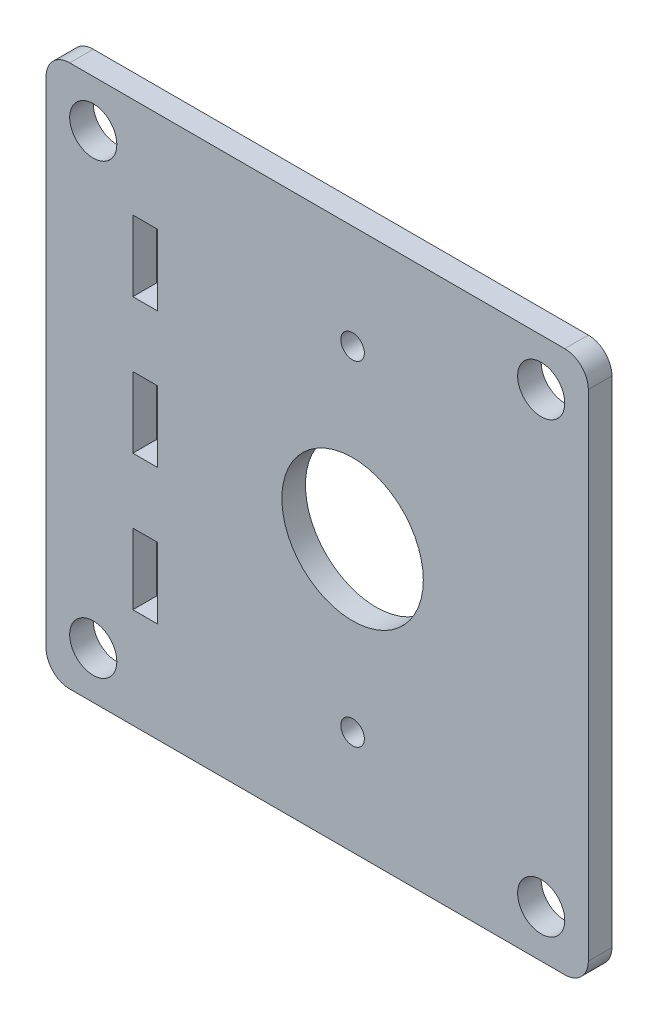
ISO-10303-21;
HEADER;
FILE_DESCRIPTION(('STEP AP214'),'2;1');
FILE_NAME('part.step','',(''),(''),'','','');
FILE_SCHEMA(('AUTOMOTIVE_DESIGN { 1 0 10303 214 1 1 1 1 }'));
ENDSEC;
DATA;
#1=APPLICATION_CONTEXT('core data for automotive mechanical design processes');
#2=APPLICATION_PROTOCOL_DEFINITION('international standard','automotive_design',2000,#1);
#3=PRODUCT_CONTEXT('',#1,'mechanical');
#4=PRODUCT('Part','Part','',(#3));
#5=PRODUCT_RELATED_PRODUCT_CATEGORY('part','',(#4));
#6=PRODUCT_DEFINITION_FORMATION('','',#4);
#7=PRODUCT_DEFINITION_CONTEXT('part definition',#1,'design');
#8=PRODUCT_DEFINITION('design','',#6,#7);
#9=PRODUCT_DEFINITION_SHAPE('','',#8);
#10=(LENGTH_UNIT() NAMED_UNIT(*) SI_UNIT(.MILLI.,.METRE.));
#11=(NAMED_UNIT(*) PLANE_ANGLE_UNIT() SI_UNIT($,.RADIAN.));
#12=(NAMED_UNIT(*) SI_UNIT($,.STERADIAN.) SOLID_ANGLE_UNIT());
#13=UNCERTAINTY_MEASURE_WITH_UNIT(LENGTH_MEASURE(1.E-05),#10,'distance_accuracy_value','');
#14=(GEOMETRIC_REPRESENTATION_CONTEXT(3) GLOBAL_UNCERTAINTY_ASSIGNED_CONTEXT((#13)) GLOBAL_UNIT_ASSIGNED_CONTEXT((#10,
#11,#12)) REPRESENTATION_CONTEXT('',''));
#15=CARTESIAN_POINT('',(0.,0.,0.));
#16=DIRECTION('',(0.,0.,1.));
#17=DIRECTION('',(1.,0.,0.));
#18=AXIS2_PLACEMENT_3D('',#15,#16,#17);
#19=CARTESIAN_POINT('',(0.,0.,3.175));
#20=DIRECTION('',(0.,0.,-1.));
#21=DIRECTION('',(-1.,0.,0.));
#22=AXIS2_PLACEMENT_3D('',#19,#20,#21);
#23=PLANE('',#22);
#24=DIRECTION('',(0.,1.,0.));
#25=VECTOR('',#24,1.);
#26=CARTESIAN_POINT('',(-52.578,-9.525,3.175));
#27=LINE('',#26,#25);
#28=CARTESIAN_POINT('',(-52.578,-9.525,3.175));
#29=VERTEX_POINT('',#28);
#30=CARTESIAN_POINT('',(-52.578,9.525,3.175));
#31=VERTEX_POINT('',#30);
#32=EDGE_CURVE('E213',#29,#31,#27,.T.);
#33=ORIENTED_EDGE('',*,*,#32,.F.);
#34=DIRECTION('',(1.,0.,0.));
#35=VECTOR('',#34,1.);
#36=CARTESIAN_POINT('',(-59.182,-9.525,3.175));
#37=LINE('',#36,#35);
#38=CARTESIAN_POINT('',(-59.182,-9.525,3.175));
#39=VERTEX_POINT('',#38);
#40=EDGE_CURVE('E221',#39,#29,#37,.T.);
#41=ORIENTED_EDGE('',*,*,#40,.F.);
#42=DIRECTION('',(0.,-1.,0.));
#43=VECTOR('',#42,1.);
#44=CARTESIAN_POINT('',(-59.182,-9.525,3.175));
#45=LINE('',#44,#43);
#46=CARTESIAN_POINT('',(-59.182,9.525,3.175));
#47=VERTEX_POINT('',#46);
#48=EDGE_CURVE('E218',#47,#39,#45,.T.);
#49=ORIENTED_EDGE('',*,*,#48,.F.);
#50=DIRECTION('',(-1.,0.,0.));
#51=VECTOR('',#50,1.);
#52=CARTESIAN_POINT('',(-59.182,9.525,3.175));
#53=LINE('',#52,#51);
#54=EDGE_CURVE('E215',#31,#47,#53,.T.);
#55=ORIENTED_EDGE('',*,*,#54,.F.);
#56=EDGE_LOOP('',(#33,#41,#49,#55));
#57=FACE_BOUND('',#56,.T.);
#58=CARTESIAN_POINT('',(-69.85,-60.325,3.175));
#59=DIRECTION('',(0.,0.,1.));
#60=DIRECTION('',(1.,0.,0.));
#61=AXIS2_PLACEMENT_3D('',#58,#59,#60);
#62=CIRCLE('',#61,6.35000000000001);
#63=CARTESIAN_POINT('',(-63.5,-60.325,3.175));
#64=VERTEX_POINT('',#63);
#65=EDGE_CURVE('E275',#64,#64,#62,.T.);
#66=ORIENTED_EDGE('',*,*,#65,.F.);
#67=EDGE_LOOP('',(#66));
#68=FACE_BOUND('',#67,.T.);
#69=CARTESIAN_POINT('',(-69.85,60.325,3.175));
#70=DIRECTION('',(0.,0.,1.));
#71=DIRECTION('',(1.,0.,0.));
#72=AXIS2_PLACEMENT_3D('',#69,#70,#71);
#73=CIRCLE('',#72,6.35000000000001);
#74=CARTESIAN_POINT('',(-63.5,60.325,3.175));
#75=VERTEX_POINT('',#74);
#76=EDGE_CURVE('E281',#75,#75,#73,.T.);
#77=ORIENTED_EDGE('',*,*,#76,.F.);
#78=EDGE_LOOP('',(#77));
#79=FACE_BOUND('',#78,.T.);
#80=CARTESIAN_POINT('',(0.,-45.,3.175));
#81=DIRECTION('',(0.,0.,1.));
#82=DIRECTION('',(1.,0.,0.));
#83=AXIS2_PLACEMENT_3D('',#80,#81,#82);
#84=CIRCLE('',#83,3.175);
#85=CARTESIAN_POINT('',(3.17500000000001,-45.,3.175));
#86=VERTEX_POINT('',#85);
#87=EDGE_CURVE('E287',#86,#86,#84,.T.);
#88=ORIENTED_EDGE('',*,*,#87,.F.);
#89=EDGE_LOOP('',(#88));
#90=FACE_BOUND('',#89,.T.);
#91=CARTESIAN_POINT('',(0.,0.,3.175));
#92=DIRECTION('',(0.,0.,1.));
#93=DIRECTION('',(1.,0.,0.));
#94=AXIS2_PLACEMENT_3D('',#91,#92,#93);
#95=CIRCLE('',#94,19.05);
#96=CARTESIAN_POINT('',(19.05,0.,3.175));
#97=VERTEX_POINT('',#96);
#98=EDGE_CURVE('E293',#97,#97,#95,.T.);
#99=ORIENTED_EDGE('',*,*,#98,.F.);
#100=EDGE_LOOP('',(#99));
#101=FACE_BOUND('',#100,.T.);
#102=CARTESIAN_POINT('',(0.,45.,3.175));
#103=DIRECTION('',(0.,0.,1.));
#104=DIRECTION('',(1.,0.,0.));
#105=AXIS2_PLACEMENT_3D('',#102,#103,#104);
#106=CIRCLE('',#105,3.175);
#107=CARTESIAN_POINT('',(3.17499999999999,45.,3.175));
#108=VERTEX_POINT('',#107);
#109=EDGE_CURVE('E299',#108,#108,#106,.T.);
#110=ORIENTED_EDGE('',*,*,#109,.F.);
#111=EDGE_LOOP('',(#110));
#112=FACE_BOUND('',#111,.T.);
#113=CARTESIAN_POINT('',(50.8,-60.325,3.175));
#114=DIRECTION('',(0.,0.,1.));
#115=DIRECTION('',(1.,0.,0.));
#116=AXIS2_PLACEMENT_3D('',#113,#114,#115);
#117=CIRCLE('',#116,6.35);
#118=CARTESIAN_POINT('',(57.15,-60.325,3.175));
#119=VERTEX_POINT('',#118);
#120=EDGE_CURVE('E305',#119,#119,#117,.T.);
#121=ORIENTED_EDGE('',*,*,#120,.F.);
#122=EDGE_LOOP('',(#121));
#123=FACE_BOUND('',#122,.T.);
#124=CARTESIAN_POINT('',(50.8,60.325,3.175));
#125=DIRECTION('',(0.,0.,1.));
#126=DIRECTION('',(1.,0.,0.));
#127=AXIS2_PLACEMENT_3D('',#124,#125,#126);
#128=CIRCLE('',#127,6.35);
#129=CARTESIAN_POINT('',(57.15,60.325,3.175));
#130=VERTEX_POINT('',#129);
#131=EDGE_CURVE('E311',#130,#130,#128,.T.);
#132=ORIENTED_EDGE('',*,*,#131,.F.);
#133=EDGE_LOOP('',(#132));
#134=FACE_BOUND('',#133,.T.);
#135=DIRECTION('',(1.,0.,0.));
#136=VECTOR('',#135,1.);
#137=CARTESIAN_POINT('',(63.5,-73.025,3.175));
#138=LINE('',#137,#136);
#139=CARTESIAN_POINT('',(-76.2,-73.025,3.175));
#140=VERTEX_POINT('',#139);
#141=CARTESIAN_POINT('',(57.15,-73.025,3.175));
#142=VERTEX_POINT('',#141);
#143=EDGE_CURVE('E320',#140,#142,#138,.T.);
#144=ORIENTED_EDGE('',*,*,#143,.T.);
#145=CARTESIAN_POINT('',(57.15,-66.675,3.175));
#146=DIRECTION('',(0.,0.,-1.));
#147=DIRECTION('',(-1.,0.,0.));
#148=AXIS2_PLACEMENT_3D('',#145,#146,#147);
#149=CIRCLE('',#148,6.35);
#150=CARTESIAN_POINT('',(63.5,-66.675,3.175));
#151=VERTEX_POINT('',#150);
#152=EDGE_CURVE('E360',#142,#151,#149,.F.);
#153=ORIENTED_EDGE('',*,*,#152,.T.);
#154=DIRECTION('',(0.,1.,0.));
#155=VECTOR('',#154,1.);
#156=CARTESIAN_POINT('',(63.5,73.025,3.175));
#157=LINE('',#156,#155);
#158=CARTESIAN_POINT('',(63.5,66.675,3.175));
#159=VERTEX_POINT('',#158);
#160=EDGE_CURVE('E324',#151,#159,#157,.T.);
#161=ORIENTED_EDGE('',*,*,#160,.T.);
#162=CARTESIAN_POINT('',(57.15,66.675,3.175));
#163=DIRECTION('',(0.,0.,-1.));
#164=DIRECTION('',(-1.,0.,0.));
#165=AXIS2_PLACEMENT_3D('',#162,#163,#164);
#166=CIRCLE('',#165,6.35);
#167=CARTESIAN_POINT('',(57.15,73.025,3.175));
#168=VERTEX_POINT('',#167);
#169=EDGE_CURVE('E54',#159,#168,#166,.F.);
#170=ORIENTED_EDGE('',*,*,#169,.T.);
#171=DIRECTION('',(-1.,0.,0.));
#172=VECTOR('',#171,1.);
#173=CARTESIAN_POINT('',(63.5,73.025,3.175));
#174=LINE('',#173,#172);
#175=CARTESIAN_POINT('',(-76.2,73.025,3.175));
#176=VERTEX_POINT('',#175);
#177=EDGE_CURVE('E326',#168,#176,#174,.T.);
#178=ORIENTED_EDGE('',*,*,#177,.T.);
#179=CARTESIAN_POINT('',(-76.2,66.675,3.175));
#180=DIRECTION('',(0.,0.,-1.));
#181=DIRECTION('',(-1.,0.,0.));
#182=AXIS2_PLACEMENT_3D('',#179,#180,#181);
#183=CIRCLE('',#182,6.35);
#184=CARTESIAN_POINT('',(-82.55,66.675,3.175));
#185=VERTEX_POINT('',#184);
#186=EDGE_CURVE('E356',#176,#185,#183,.F.);
#187=ORIENTED_EDGE('',*,*,#186,.T.);
#188=DIRECTION('',(0.,-1.,0.));
#189=VECTOR('',#188,1.);
#190=CARTESIAN_POINT('',(-82.55,73.025,3.175));
#191=LINE('',#190,#189);
#192=CARTESIAN_POINT('',(-82.55,-66.675,3.175));
#193=VERTEX_POINT('',#192);
#194=EDGE_CURVE('E317',#185,#193,#191,.T.);
#195=ORIENTED_EDGE('',*,*,#194,.T.);
#196=CARTESIAN_POINT('',(-76.2,-66.675,3.175));
#197=DIRECTION('',(0.,0.,-1.));
#198=DIRECTION('',(-1.,0.,0.));
#199=AXIS2_PLACEMENT_3D('',#196,#197,#198);
#200=CIRCLE('',#199,6.35);
#201=EDGE_CURVE('E358',#193,#140,#200,.F.);
#202=ORIENTED_EDGE('',*,*,#201,.T.);
#203=EDGE_LOOP('',(#144,#153,#161,#170,#178,#187,#195,#202));
#204=FACE_BOUND('',#203,.T.);
#205=DIRECTION('',(0.,1.,0.));
#206=VECTOR('',#205,1.);
#207=CARTESIAN_POINT('',(-52.578,46.0375,3.175));
#208=LINE('',#207,#206);
#209=CARTESIAN_POINT('',(-52.578,26.9875,3.175));
#210=VERTEX_POINT('',#209);
#211=CARTESIAN_POINT('',(-52.578,46.0375,3.175));
#212=VERTEX_POINT('',#211);
#213=EDGE_CURVE('E244',#210,#212,#208,.T.);
#214=ORIENTED_EDGE('',*,*,#213,.F.);
#215=DIRECTION('',(1.,0.,0.));
#216=VECTOR('',#215,1.);
#217=CARTESIAN_POINT('',(-59.182,26.9875,3.175));
#218=LINE('',#217,#216);
#219=CARTESIAN_POINT('',(-59.182,26.9875,3.175));
#220=VERTEX_POINT('',#219);
#221=EDGE_CURVE('E252',#220,#210,#218,.T.);
#222=ORIENTED_EDGE('',*,*,#221,.F.);
#223=DIRECTION('',(0.,-1.,0.));
#224=VECTOR('',#223,1.);
#225=CARTESIAN_POINT('',(-59.182,46.0375,3.175));
#226=LINE('',#225,#224);
#227=CARTESIAN_POINT('',(-59.182,46.0375,3.175));
#228=VERTEX_POINT('',#227);
#229=EDGE_CURVE('E249',#228,#220,#226,.T.);
#230=ORIENTED_EDGE('',*,*,#229,.F.);
#231=DIRECTION('',(-1.,0.,0.));
#232=VECTOR('',#231,1.);
#233=CARTESIAN_POINT('',(-59.182,46.0375,3.175));
#234=LINE('',#233,#232);
#235=EDGE_CURVE('E246',#212,#228,#234,.T.);
#236=ORIENTED_EDGE('',*,*,#235,.F.);
#237=EDGE_LOOP('',(#214,#222,#230,#236));
#238=FACE_BOUND('',#237,.T.);
#239=DIRECTION('',(0.,1.,0.));
#240=VECTOR('',#239,1.);
#241=CARTESIAN_POINT('',(-52.578,-26.9875,3.175));
#242=LINE('',#241,#240);
#243=CARTESIAN_POINT('',(-52.578,-46.0375,3.175));
#244=VERTEX_POINT('',#243);
#245=CARTESIAN_POINT('',(-52.578,-26.9875,3.175));
#246=VERTEX_POINT('',#245);
#247=EDGE_CURVE('E172',#244,#246,#242,.T.);
#248=ORIENTED_EDGE('',*,*,#247,.F.);
#249=DIRECTION('',(1.,0.,0.));
#250=VECTOR('',#249,1.);
#251=CARTESIAN_POINT('',(-59.182,-46.0375,3.175));
#252=LINE('',#251,#250);
#253=CARTESIAN_POINT('',(-59.182,-46.0375,3.175));
#254=VERTEX_POINT('',#253);
#255=EDGE_CURVE('E197',#254,#244,#252,.T.);
#256=ORIENTED_EDGE('',*,*,#255,.F.);
#257=DIRECTION('',(0.,-1.,0.));
#258=VECTOR('',#257,1.);
#259=CARTESIAN_POINT('',(-59.182,-26.9875,3.175));
#260=LINE('',#259,#258);
#261=CARTESIAN_POINT('',(-59.182,-26.9875,3.175));
#262=VERTEX_POINT('',#261);
#263=EDGE_CURVE('E195',#262,#254,#260,.T.);
#264=ORIENTED_EDGE('',*,*,#263,.F.);
#265=DIRECTION('',(-1.,0.,0.));
#266=VECTOR('',#265,1.);
#267=CARTESIAN_POINT('',(-59.182,-26.9875,3.175));
#268=LINE('',#267,#266);
#269=EDGE_CURVE('E182',#246,#262,#268,.T.);
#270=ORIENTED_EDGE('',*,*,#269,.F.);
#271=EDGE_LOOP('',(#248,#256,#264,#270));
#272=FACE_BOUND('',#271,.T.);
#273=ADVANCED_FACE('F34',(#57,#68,#79,#90,#101,#112,#123,#134,#204,#238,#272),#23,.F.);
#274=CARTESIAN_POINT('',(0.,0.,-3.175));
#275=DIRECTION('',(0.,0.,-1.));
#276=DIRECTION('',(-1.,0.,0.));
#277=AXIS2_PLACEMENT_3D('',#274,#275,#276);
#278=PLANE('',#277);
#279=CARTESIAN_POINT('',(-69.85,60.325,-3.175));
#280=DIRECTION('',(0.,0.,1.));
#281=DIRECTION('',(1.,0.,0.));
#282=AXIS2_PLACEMENT_3D('',#279,#280,#281);
#283=CIRCLE('',#282,6.35000000000001);
#284=CARTESIAN_POINT('',(-63.5,60.325,-3.175));
#285=VERTEX_POINT('',#284);
#286=EDGE_CURVE('E278',#285,#285,#283,.T.);
#287=ORIENTED_EDGE('',*,*,#286,.T.);
#288=EDGE_LOOP('',(#287));
#289=FACE_BOUND('',#288,.T.);
#290=CARTESIAN_POINT('',(0.,0.,-3.175));
#291=DIRECTION('',(0.,0.,1.));
#292=DIRECTION('',(1.,0.,0.));
#293=AXIS2_PLACEMENT_3D('',#290,#291,#292);
#294=CIRCLE('',#293,19.05);
#295=CARTESIAN_POINT('',(19.05,0.,-3.175));
#296=VERTEX_POINT('',#295);
#297=EDGE_CURVE('E290',#296,#296,#294,.T.);
#298=ORIENTED_EDGE('',*,*,#297,.T.);
#299=EDGE_LOOP('',(#298));
#300=FACE_BOUND('',#299,.T.);
#301=CARTESIAN_POINT('',(50.8,-60.325,-3.175));
#302=DIRECTION('',(0.,0.,1.));
#303=DIRECTION('',(1.,0.,0.));
#304=AXIS2_PLACEMENT_3D('',#301,#302,#303);
#305=CIRCLE('',#304,6.35);
#306=CARTESIAN_POINT('',(57.15,-60.325,-3.175));
#307=VERTEX_POINT('',#306);
#308=EDGE_CURVE('E302',#307,#307,#305,.T.);
#309=ORIENTED_EDGE('',*,*,#308,.T.);
#310=EDGE_LOOP('',(#309));
#311=FACE_BOUND('',#310,.T.);
#312=DIRECTION('',(0.,1.,0.));
#313=VECTOR('',#312,1.);
#314=CARTESIAN_POINT('',(63.5,73.025,-3.175));
#315=LINE('',#314,#313);
#316=CARTESIAN_POINT('',(63.5,-66.675,-3.175));
#317=VERTEX_POINT('',#316);
#318=CARTESIAN_POINT('',(63.5,66.675,-3.175));
#319=VERTEX_POINT('',#318);
#320=EDGE_CURVE('E334',#317,#319,#315,.T.);
#321=ORIENTED_EDGE('',*,*,#320,.F.);
#322=CARTESIAN_POINT('',(57.15,-66.675,-3.175));
#323=DIRECTION('',(0.,0.,-1.));
#324=DIRECTION('',(-1.,0.,0.));
#325=AXIS2_PLACEMENT_3D('',#322,#323,#324);
#326=CIRCLE('',#325,6.35);
#327=CARTESIAN_POINT('',(57.15,-73.025,-3.175));
#328=VERTEX_POINT('',#327);
#329=EDGE_CURVE('E348',#317,#328,#326,.T.);
#330=ORIENTED_EDGE('',*,*,#329,.T.);
#331=DIRECTION('',(1.,0.,0.));
#332=VECTOR('',#331,1.);
#333=CARTESIAN_POINT('',(63.5,-73.025,-3.175));
#334=LINE('',#333,#332);
#335=CARTESIAN_POINT('',(-76.2,-73.025,-3.175));
#336=VERTEX_POINT('',#335);
#337=EDGE_CURVE('E331',#336,#328,#334,.T.);
#338=ORIENTED_EDGE('',*,*,#337,.F.);
#339=CARTESIAN_POINT('',(-76.2,-66.675,-3.175));
#340=DIRECTION('',(0.,0.,-1.));
#341=DIRECTION('',(-1.,0.,0.));
#342=AXIS2_PLACEMENT_3D('',#339,#340,#341);
#343=CIRCLE('',#342,6.35);
#344=CARTESIAN_POINT('',(-82.55,-66.675,-3.175));
#345=VERTEX_POINT('',#344);
#346=EDGE_CURVE('E346',#336,#345,#343,.T.);
#347=ORIENTED_EDGE('',*,*,#346,.T.);
#348=DIRECTION('',(0.,-1.,0.));
#349=VECTOR('',#348,1.);
#350=CARTESIAN_POINT('',(-82.55,73.025,-3.175));
#351=LINE('',#350,#349);
#352=CARTESIAN_POINT('',(-82.55,66.675,-3.175));
#353=VERTEX_POINT('',#352);
#354=EDGE_CURVE('E314',#353,#345,#351,.T.);
#355=ORIENTED_EDGE('',*,*,#354,.F.);
#356=CARTESIAN_POINT('',(-76.2,66.675,-3.175));
#357=DIRECTION('',(0.,0.,-1.));
#358=DIRECTION('',(-1.,0.,0.));
#359=AXIS2_PLACEMENT_3D('',#356,#357,#358);
#360=CIRCLE('',#359,6.35);
#361=CARTESIAN_POINT('',(-76.2,73.025,-3.175));
#362=VERTEX_POINT('',#361);
#363=EDGE_CURVE('E344',#353,#362,#360,.T.);
#364=ORIENTED_EDGE('',*,*,#363,.T.);
#365=DIRECTION('',(-1.,0.,0.));
#366=VECTOR('',#365,1.);
#367=CARTESIAN_POINT('',(63.5,73.025,-3.175));
#368=LINE('',#367,#366);
#369=CARTESIAN_POINT('',(57.15,73.025,-3.175));
#370=VERTEX_POINT('',#369);
#371=EDGE_CURVE('E321',#370,#362,#368,.T.);
#372=ORIENTED_EDGE('',*,*,#371,.F.);
#373=CARTESIAN_POINT('',(57.15,66.675,-3.175));
#374=DIRECTION('',(0.,0.,-1.));
#375=DIRECTION('',(-1.,0.,0.));
#376=AXIS2_PLACEMENT_3D('',#373,#374,#375);
#377=CIRCLE('',#376,6.35);
#378=EDGE_CURVE('E342',#370,#319,#377,.T.);
#379=ORIENTED_EDGE('',*,*,#378,.T.);
#380=EDGE_LOOP('',(#321,#330,#338,#347,#355,#364,#372,#379));
#381=FACE_BOUND('',#380,.T.);
#382=CARTESIAN_POINT('',(50.8,60.325,-3.175));
#383=DIRECTION('',(0.,0.,1.));
#384=DIRECTION('',(1.,0.,0.));
#385=AXIS2_PLACEMENT_3D('',#382,#383,#384);
#386=CIRCLE('',#385,6.35);
#387=CARTESIAN_POINT('',(57.15,60.325,-3.175));
#388=VERTEX_POINT('',#387);
#389=EDGE_CURVE('E308',#388,#388,#386,.T.);
#390=ORIENTED_EDGE('',*,*,#389,.T.);
#391=EDGE_LOOP('',(#390));
#392=FACE_BOUND('',#391,.T.);
#393=CARTESIAN_POINT('',(0.,45.,-3.175));
#394=DIRECTION('',(0.,0.,1.));
#395=DIRECTION('',(1.,0.,0.));
#396=AXIS2_PLACEMENT_3D('',#393,#394,#395);
#397=CIRCLE('',#396,3.175);
#398=CARTESIAN_POINT('',(3.17499999999999,45.,-3.175));
#399=VERTEX_POINT('',#398);
#400=EDGE_CURVE('E296',#399,#399,#397,.T.);
#401=ORIENTED_EDGE('',*,*,#400,.T.);
#402=EDGE_LOOP('',(#401));
#403=FACE_BOUND('',#402,.T.);
#404=CARTESIAN_POINT('',(0.,-45.,-3.175));
#405=DIRECTION('',(0.,0.,1.));
#406=DIRECTION('',(1.,0.,0.));
#407=AXIS2_PLACEMENT_3D('',#404,#405,#406);
#408=CIRCLE('',#407,3.175);
#409=CARTESIAN_POINT('',(3.17500000000001,-45.,-3.175));
#410=VERTEX_POINT('',#409);
#411=EDGE_CURVE('E284',#410,#410,#408,.T.);
#412=ORIENTED_EDGE('',*,*,#411,.T.);
#413=EDGE_LOOP('',(#412));
#414=FACE_BOUND('',#413,.T.);
#415=CARTESIAN_POINT('',(-69.85,-60.325,-3.175));
#416=DIRECTION('',(0.,0.,1.));
#417=DIRECTION('',(1.,0.,0.));
#418=AXIS2_PLACEMENT_3D('',#415,#416,#417);
#419=CIRCLE('',#418,6.35000000000001);
#420=CARTESIAN_POINT('',(-63.5,-60.325,-3.175));
#421=VERTEX_POINT('',#420);
#422=EDGE_CURVE('E274',#421,#421,#419,.T.);
#423=ORIENTED_EDGE('',*,*,#422,.T.);
#424=EDGE_LOOP('',(#423));
#425=FACE_BOUND('',#424,.T.);
#426=DIRECTION('',(1.,0.,0.));
#427=VECTOR('',#426,1.);
#428=CARTESIAN_POINT('',(-59.182,26.9875,-3.175));
#429=LINE('',#428,#427);
#430=CARTESIAN_POINT('',(-59.182,26.9875,-3.175));
#431=VERTEX_POINT('',#430);
#432=CARTESIAN_POINT('',(-52.578,26.9875,-3.175));
#433=VERTEX_POINT('',#432);
#434=EDGE_CURVE('E247',#431,#433,#429,.T.);
#435=ORIENTED_EDGE('',*,*,#434,.T.);
#436=DIRECTION('',(0.,1.,0.));
#437=VECTOR('',#436,1.);
#438=CARTESIAN_POINT('',(-52.578,46.0375,-3.175));
#439=LINE('',#438,#437);
#440=CARTESIAN_POINT('',(-52.578,46.0375,-3.175));
#441=VERTEX_POINT('',#440);
#442=EDGE_CURVE('E243',#433,#441,#439,.T.);
#443=ORIENTED_EDGE('',*,*,#442,.T.);
#444=DIRECTION('',(-1.,0.,0.));
#445=VECTOR('',#444,1.);
#446=CARTESIAN_POINT('',(-59.182,46.0375,-3.175));
#447=LINE('',#446,#445);
#448=CARTESIAN_POINT('',(-59.182,46.0375,-3.175));
#449=VERTEX_POINT('',#448);
#450=EDGE_CURVE('E257',#441,#449,#447,.T.);
#451=ORIENTED_EDGE('',*,*,#450,.T.);
#452=DIRECTION('',(0.,-1.,0.));
#453=VECTOR('',#452,1.);
#454=CARTESIAN_POINT('',(-59.182,46.0375,-3.175));
#455=LINE('',#454,#453);
#456=EDGE_CURVE('E260',#449,#431,#455,.T.);
#457=ORIENTED_EDGE('',*,*,#456,.T.);
#458=EDGE_LOOP('',(#435,#443,#451,#457));
#459=FACE_BOUND('',#458,.T.);
#460=DIRECTION('',(1.,0.,0.));
#461=VECTOR('',#460,1.);
#462=CARTESIAN_POINT('',(-59.182,-9.525,-3.175));
#463=LINE('',#462,#461);
#464=CARTESIAN_POINT('',(-59.182,-9.525,-3.175));
#465=VERTEX_POINT('',#464);
#466=CARTESIAN_POINT('',(-52.578,-9.525,-3.175));
#467=VERTEX_POINT('',#466);
#468=EDGE_CURVE('E216',#465,#467,#463,.T.);
#469=ORIENTED_EDGE('',*,*,#468,.T.);
#470=DIRECTION('',(0.,1.,0.));
#471=VECTOR('',#470,1.);
#472=CARTESIAN_POINT('',(-52.578,-9.525,-3.175));
#473=LINE('',#472,#471);
#474=CARTESIAN_POINT('',(-52.578,9.525,-3.175));
#475=VERTEX_POINT('',#474);
#476=EDGE_CURVE('E190',#467,#475,#473,.T.);
#477=ORIENTED_EDGE('',*,*,#476,.T.);
#478=DIRECTION('',(-1.,0.,0.));
#479=VECTOR('',#478,1.);
#480=CARTESIAN_POINT('',(-59.182,9.525,-3.175));
#481=LINE('',#480,#479);
#482=CARTESIAN_POINT('',(-59.182,9.525,-3.175));
#483=VERTEX_POINT('',#482);
#484=EDGE_CURVE('E226',#475,#483,#481,.T.);
#485=ORIENTED_EDGE('',*,*,#484,.T.);
#486=DIRECTION('',(0.,-1.,0.));
#487=VECTOR('',#486,1.);
#488=CARTESIAN_POINT('',(-59.182,-9.525,-3.175));
#489=LINE('',#488,#487);
#490=EDGE_CURVE('E229',#483,#465,#489,.T.);
#491=ORIENTED_EDGE('',*,*,#490,.T.);
#492=EDGE_LOOP('',(#469,#477,#485,#491));
#493=FACE_BOUND('',#492,.T.);
#494=DIRECTION('',(1.,0.,0.));
#495=VECTOR('',#494,1.);
#496=CARTESIAN_POINT('',(-59.182,-46.0375,-3.175));
#497=LINE('',#496,#495);
#498=CARTESIAN_POINT('',(-59.182,-46.0375,-3.175));
#499=VERTEX_POINT('',#498);
#500=CARTESIAN_POINT('',(-52.578,-46.0375,-3.175));
#501=VERTEX_POINT('',#500);
#502=EDGE_CURVE('E183',#499,#501,#497,.T.);
#503=ORIENTED_EDGE('',*,*,#502,.T.);
#504=DIRECTION('',(0.,1.,0.));
#505=VECTOR('',#504,1.);
#506=CARTESIAN_POINT('',(-52.578,-26.9875,-3.175));
#507=LINE('',#506,#505);
#508=CARTESIAN_POINT('',(-52.578,-26.9875,-3.175));
#509=VERTEX_POINT('',#508);
#510=EDGE_CURVE('E201',#501,#509,#507,.T.);
#511=ORIENTED_EDGE('',*,*,#510,.T.);
#512=DIRECTION('',(-1.,0.,0.));
#513=VECTOR('',#512,1.);
#514=CARTESIAN_POINT('',(-59.182,-26.9875,-3.175));
#515=LINE('',#514,#513);
#516=CARTESIAN_POINT('',(-59.182,-26.9875,-3.175));
#517=VERTEX_POINT('',#516);
#518=EDGE_CURVE('E189',#509,#517,#515,.T.);
#519=ORIENTED_EDGE('',*,*,#518,.T.);
#520=DIRECTION('',(0.,-1.,0.));
#521=VECTOR('',#520,1.);
#522=CARTESIAN_POINT('',(-59.182,-26.9875,-3.175));
#523=LINE('',#522,#521);
#524=EDGE_CURVE('E204',#517,#499,#523,.T.);
#525=ORIENTED_EDGE('',*,*,#524,.T.);
#526=EDGE_LOOP('',(#503,#511,#519,#525));
#527=FACE_BOUND('',#526,.T.);
#528=ADVANCED_FACE('F373',(#289,#300,#311,#381,#392,#403,#414,#425,#459,#493,#527),#278,.T.);
#529=CARTESIAN_POINT('',(-82.55,73.025,3.175));
#530=DIRECTION('',(1.,0.,0.));
#531=DIRECTION('',(0.,1.,0.));
#532=AXIS2_PLACEMENT_3D('',#529,#530,#531);
#533=PLANE('',#532);
#534=ORIENTED_EDGE('',*,*,#354,.T.);
#535=DIRECTION('',(0.,0.,-1.));
#536=VECTOR('',#535,1.);
#537=CARTESIAN_POINT('',(-82.55,-66.675,3.175));
#538=LINE('',#537,#536);
#539=EDGE_CURVE('E365',#345,#193,#538,.F.);
#540=ORIENTED_EDGE('',*,*,#539,.T.);
#541=ORIENTED_EDGE('',*,*,#194,.F.);
#542=DIRECTION('',(0.,0.,-1.));
#543=VECTOR('',#542,1.);
#544=CARTESIAN_POINT('',(-82.55,66.675,3.175));
#545=LINE('',#544,#543);
#546=EDGE_CURVE('E362',#185,#353,#545,.T.);
#547=ORIENTED_EDGE('',*,*,#546,.T.);
#548=EDGE_LOOP('',(#534,#540,#541,#547));
#549=FACE_BOUND('',#548,.T.);
#550=ADVANCED_FACE('F382',(#549),#533,.F.);
#551=CARTESIAN_POINT('',(63.5,-73.025,3.175));
#552=DIRECTION('',(0.,1.,0.));
#553=DIRECTION('',(-1.,0.,0.));
#554=AXIS2_PLACEMENT_3D('',#551,#552,#553);
#555=PLANE('',#554);
#556=ORIENTED_EDGE('',*,*,#337,.T.);
#557=DIRECTION('',(0.,0.,-1.));
#558=VECTOR('',#557,1.);
#559=CARTESIAN_POINT('',(57.15,-73.025,3.175));
#560=LINE('',#559,#558);
#561=EDGE_CURVE('E353',#328,#142,#560,.F.);
#562=ORIENTED_EDGE('',*,*,#561,.T.);
#563=ORIENTED_EDGE('',*,*,#143,.F.);
#564=DIRECTION('',(0.,0.,-1.));
#565=VECTOR('',#564,1.);
#566=CARTESIAN_POINT('',(-76.2,-73.025,3.175));
#567=LINE('',#566,#565);
#568=EDGE_CURVE('E350',#140,#336,#567,.T.);
#569=ORIENTED_EDGE('',*,*,#568,.T.);
#570=EDGE_LOOP('',(#556,#562,#563,#569));
#571=FACE_BOUND('',#570,.T.);
#572=ADVANCED_FACE('F392',(#571),#555,.F.);
#573=CARTESIAN_POINT('',(63.5,73.025,3.175));
#574=DIRECTION('',(-1.,0.,0.));
#575=DIRECTION('',(0.,-1.,0.));
#576=AXIS2_PLACEMENT_3D('',#573,#574,#575);
#577=PLANE('',#576);
#578=ORIENTED_EDGE('',*,*,#160,.F.);
#579=DIRECTION('',(0.,0.,-1.));
#580=VECTOR('',#579,1.);
#581=CARTESIAN_POINT('',(63.5,-66.675,3.175));
#582=LINE('',#581,#580);
#583=EDGE_CURVE('E339',#151,#317,#582,.T.);
#584=ORIENTED_EDGE('',*,*,#583,.T.);
#585=ORIENTED_EDGE('',*,*,#320,.T.);
#586=DIRECTION('',(0.,0.,-1.));
#587=VECTOR('',#586,1.);
#588=CARTESIAN_POINT('',(63.5,66.675,3.175));
#589=LINE('',#588,#587);
#590=EDGE_CURVE('E328',#319,#159,#589,.F.);
#591=ORIENTED_EDGE('',*,*,#590,.T.);
#592=EDGE_LOOP('',(#578,#584,#585,#591));
#593=FACE_BOUND('',#592,.T.);
#594=ADVANCED_FACE('F400',(#593),#577,.F.);
#595=CARTESIAN_POINT('',(63.5,73.025,3.175));
#596=DIRECTION('',(0.,-1.,0.));
#597=DIRECTION('',(1.,0.,0.));
#598=AXIS2_PLACEMENT_3D('',#595,#596,#597);
#599=PLANE('',#598);
#600=ORIENTED_EDGE('',*,*,#371,.T.);
#601=DIRECTION('',(0.,0.,-1.));
#602=VECTOR('',#601,1.);
#603=CARTESIAN_POINT('',(-76.2,73.025,3.175));
#604=LINE('',#603,#602);
#605=EDGE_CURVE('E11',#362,#176,#604,.F.);
#606=ORIENTED_EDGE('',*,*,#605,.T.);
#607=ORIENTED_EDGE('',*,*,#177,.F.);
#608=DIRECTION('',(0.,0.,-1.));
#609=VECTOR('',#608,1.);
#610=CARTESIAN_POINT('',(57.15,73.025,3.175));
#611=LINE('',#610,#609);
#612=EDGE_CURVE('E42',#168,#370,#611,.T.);
#613=ORIENTED_EDGE('',*,*,#612,.T.);
#614=EDGE_LOOP('',(#600,#606,#607,#613));
#615=FACE_BOUND('',#614,.T.);
#616=ADVANCED_FACE('F369',(#615),#599,.F.);
#617=CARTESIAN_POINT('',(50.8,60.325,3.175));
#618=DIRECTION('',(0.,0.,-1.));
#619=DIRECTION('',(-1.,0.,0.));
#620=AXIS2_PLACEMENT_3D('',#617,#618,#619);
#621=CYLINDRICAL_SURFACE('',#620,6.35);
#622=ORIENTED_EDGE('',*,*,#131,.T.);
#623=EDGE_LOOP('',(#622));
#624=FACE_BOUND('',#623,.T.);
#625=ORIENTED_EDGE('',*,*,#389,.F.);
#626=EDGE_LOOP('',(#625));
#627=FACE_BOUND('',#626,.T.);
#628=ADVANCED_FACE('F417',(#624,#627),#621,.F.);
#629=CARTESIAN_POINT('',(50.8,-60.325,3.175));
#630=DIRECTION('',(0.,0.,-1.));
#631=DIRECTION('',(-1.,0.,0.));
#632=AXIS2_PLACEMENT_3D('',#629,#630,#631);
#633=CYLINDRICAL_SURFACE('',#632,6.35);
#634=ORIENTED_EDGE('',*,*,#120,.T.);
#635=EDGE_LOOP('',(#634));
#636=FACE_BOUND('',#635,.T.);
#637=ORIENTED_EDGE('',*,*,#308,.F.);
#638=EDGE_LOOP('',(#637));
#639=FACE_BOUND('',#638,.T.);
#640=ADVANCED_FACE('F601',(#636,#639),#633,.F.);
#641=CARTESIAN_POINT('',(0.,45.,3.175));
#642=DIRECTION('',(0.,0.,-1.));
#643=DIRECTION('',(-1.,0.,0.));
#644=AXIS2_PLACEMENT_3D('',#641,#642,#643);
#645=CYLINDRICAL_SURFACE('',#644,3.175);
#646=ORIENTED_EDGE('',*,*,#109,.T.);
#647=EDGE_LOOP('',(#646));
#648=FACE_BOUND('',#647,.T.);
#649=ORIENTED_EDGE('',*,*,#400,.F.);
#650=EDGE_LOOP('',(#649));
#651=FACE_BOUND('',#650,.T.);
#652=ADVANCED_FACE('F592',(#648,#651),#645,.F.);
#653=CARTESIAN_POINT('',(0.,0.,3.175));
#654=DIRECTION('',(0.,0.,-1.));
#655=DIRECTION('',(-1.,0.,0.));
#656=AXIS2_PLACEMENT_3D('',#653,#654,#655);
#657=CYLINDRICAL_SURFACE('',#656,19.05);
#658=ORIENTED_EDGE('',*,*,#98,.T.);
#659=EDGE_LOOP('',(#658));
#660=FACE_BOUND('',#659,.T.);
#661=ORIENTED_EDGE('',*,*,#297,.F.);
#662=EDGE_LOOP('',(#661));
#663=FACE_BOUND('',#662,.T.);
#664=ADVANCED_FACE('F583',(#660,#663),#657,.F.);
#665=CARTESIAN_POINT('',(0.,-45.,3.175));
#666=DIRECTION('',(0.,0.,-1.));
#667=DIRECTION('',(-1.,0.,0.));
#668=AXIS2_PLACEMENT_3D('',#665,#666,#667);
#669=CYLINDRICAL_SURFACE('',#668,3.175);
#670=ORIENTED_EDGE('',*,*,#87,.T.);
#671=EDGE_LOOP('',(#670));
#672=FACE_BOUND('',#671,.T.);
#673=ORIENTED_EDGE('',*,*,#411,.F.);
#674=EDGE_LOOP('',(#673));
#675=FACE_BOUND('',#674,.T.);
#676=ADVANCED_FACE('F574',(#672,#675),#669,.F.);
#677=CARTESIAN_POINT('',(-69.85,60.325,3.175));
#678=DIRECTION('',(0.,0.,-1.));
#679=DIRECTION('',(-1.,0.,0.));
#680=AXIS2_PLACEMENT_3D('',#677,#678,#679);
#681=CYLINDRICAL_SURFACE('',#680,6.35000000000001);
#682=ORIENTED_EDGE('',*,*,#76,.T.);
#683=EDGE_LOOP('',(#682));
#684=FACE_BOUND('',#683,.T.);
#685=ORIENTED_EDGE('',*,*,#286,.F.);
#686=EDGE_LOOP('',(#685));
#687=FACE_BOUND('',#686,.T.);
#688=ADVANCED_FACE('F565',(#684,#687),#681,.F.);
#689=CARTESIAN_POINT('',(-69.85,-60.325,3.175));
#690=DIRECTION('',(0.,0.,-1.));
#691=DIRECTION('',(-1.,0.,0.));
#692=AXIS2_PLACEMENT_3D('',#689,#690,#691);
#693=CYLINDRICAL_SURFACE('',#692,6.35000000000001);
#694=ORIENTED_EDGE('',*,*,#65,.T.);
#695=EDGE_LOOP('',(#694));
#696=FACE_BOUND('',#695,.T.);
#697=ORIENTED_EDGE('',*,*,#422,.F.);
#698=EDGE_LOOP('',(#697));
#699=FACE_BOUND('',#698,.T.);
#700=ADVANCED_FACE('F556',(#696,#699),#693,.F.);
#701=CARTESIAN_POINT('',(-52.578,46.0375,3.175));
#702=DIRECTION('',(-1.,0.,0.));
#703=DIRECTION('',(0.,-1.,0.));
#704=AXIS2_PLACEMENT_3D('',#701,#702,#703);
#705=PLANE('',#704);
#706=ORIENTED_EDGE('',*,*,#442,.F.);
#707=DIRECTION('',(0.,0.,-1.));
#708=VECTOR('',#707,1.);
#709=CARTESIAN_POINT('',(-52.578,26.9875,3.175));
#710=LINE('',#709,#708);
#711=EDGE_CURVE('E254',#210,#433,#710,.T.);
#712=ORIENTED_EDGE('',*,*,#711,.F.);
#713=ORIENTED_EDGE('',*,*,#213,.T.);
#714=DIRECTION('',(0.,0.,-1.));
#715=VECTOR('',#714,1.);
#716=CARTESIAN_POINT('',(-52.578,46.0375,3.175));
#717=LINE('',#716,#715);
#718=EDGE_CURVE('E271',#212,#441,#717,.T.);
#719=ORIENTED_EDGE('',*,*,#718,.T.);
#720=EDGE_LOOP('',(#706,#712,#713,#719));
#721=FACE_BOUND('',#720,.T.);
#722=ADVANCED_FACE('F547',(#721),#705,.T.);
#723=CARTESIAN_POINT('',(-59.182,46.0375,3.175));
#724=DIRECTION('',(0.,-1.,0.));
#725=DIRECTION('',(0.,0.,-1.));
#726=AXIS2_PLACEMENT_3D('',#723,#724,#725);
#727=PLANE('',#726);
#728=ORIENTED_EDGE('',*,*,#450,.F.);
#729=ORIENTED_EDGE('',*,*,#718,.F.);
#730=ORIENTED_EDGE('',*,*,#235,.T.);
#731=DIRECTION('',(0.,0.,-1.));
#732=VECTOR('',#731,1.);
#733=CARTESIAN_POINT('',(-59.182,46.0375,3.175));
#734=LINE('',#733,#732);
#735=EDGE_CURVE('E269',#228,#449,#734,.T.);
#736=ORIENTED_EDGE('',*,*,#735,.T.);
#737=EDGE_LOOP('',(#728,#729,#730,#736));
#738=FACE_BOUND('',#737,.T.);
#739=ADVANCED_FACE('F538',(#738),#727,.T.);
#740=CARTESIAN_POINT('',(-59.182,46.0375,3.175));
#741=DIRECTION('',(1.,0.,0.));
#742=DIRECTION('',(0.,1.,0.));
#743=AXIS2_PLACEMENT_3D('',#740,#741,#742);
#744=PLANE('',#743);
#745=ORIENTED_EDGE('',*,*,#456,.F.);
#746=ORIENTED_EDGE('',*,*,#735,.F.);
#747=ORIENTED_EDGE('',*,*,#229,.T.);
#748=DIRECTION('',(0.,0.,-1.));
#749=VECTOR('',#748,1.);
#750=CARTESIAN_POINT('',(-59.182,26.9875,3.175));
#751=LINE('',#750,#749);
#752=EDGE_CURVE('E267',#220,#431,#751,.T.);
#753=ORIENTED_EDGE('',*,*,#752,.T.);
#754=EDGE_LOOP('',(#745,#746,#747,#753));
#755=FACE_BOUND('',#754,.T.);
#756=ADVANCED_FACE('F529',(#755),#744,.T.);
#757=CARTESIAN_POINT('',(-59.182,26.9875,3.175));
#758=DIRECTION('',(0.,1.,0.));
#759=DIRECTION('',(-1.,0.,0.));
#760=AXIS2_PLACEMENT_3D('',#757,#758,#759);
#761=PLANE('',#760);
#762=ORIENTED_EDGE('',*,*,#434,.F.);
#763=ORIENTED_EDGE('',*,*,#752,.F.);
#764=ORIENTED_EDGE('',*,*,#221,.T.);
#765=ORIENTED_EDGE('',*,*,#711,.T.);
#766=EDGE_LOOP('',(#762,#763,#764,#765));
#767=FACE_BOUND('',#766,.T.);
#768=ADVANCED_FACE('F520',(#767),#761,.T.);
#769=CARTESIAN_POINT('',(-52.578,-9.525,3.175));
#770=DIRECTION('',(-1.,0.,0.));
#771=DIRECTION('',(0.,0.,1.));
#772=AXIS2_PLACEMENT_3D('',#769,#770,#771);
#773=PLANE('',#772);
#774=ORIENTED_EDGE('',*,*,#476,.F.);
#775=DIRECTION('',(0.,0.,-1.));
#776=VECTOR('',#775,1.);
#777=CARTESIAN_POINT('',(-52.578,-9.525,3.175));
#778=LINE('',#777,#776);
#779=EDGE_CURVE('E223',#29,#467,#778,.T.);
#780=ORIENTED_EDGE('',*,*,#779,.F.);
#781=ORIENTED_EDGE('',*,*,#32,.T.);
#782=DIRECTION('',(0.,0.,-1.));
#783=VECTOR('',#782,1.);
#784=CARTESIAN_POINT('',(-52.578,9.525,3.175));
#785=LINE('',#784,#783);
#786=EDGE_CURVE('E240',#31,#475,#785,.T.);
#787=ORIENTED_EDGE('',*,*,#786,.T.);
#788=EDGE_LOOP('',(#774,#780,#781,#787));
#789=FACE_BOUND('',#788,.T.);
#790=ADVANCED_FACE('F511',(#789),#773,.T.);
#791=CARTESIAN_POINT('',(-59.182,9.525,3.175));
#792=DIRECTION('',(0.,-1.,0.));
#793=DIRECTION('',(0.,0.,-1.));
#794=AXIS2_PLACEMENT_3D('',#791,#792,#793);
#795=PLANE('',#794);
#796=ORIENTED_EDGE('',*,*,#484,.F.);
#797=ORIENTED_EDGE('',*,*,#786,.F.);
#798=ORIENTED_EDGE('',*,*,#54,.T.);
#799=DIRECTION('',(0.,0.,-1.));
#800=VECTOR('',#799,1.);
#801=CARTESIAN_POINT('',(-59.182,9.525,3.175));
#802=LINE('',#801,#800);
#803=EDGE_CURVE('E238',#47,#483,#802,.T.);
#804=ORIENTED_EDGE('',*,*,#803,.T.);
#805=EDGE_LOOP('',(#796,#797,#798,#804));
#806=FACE_BOUND('',#805,.T.);
#807=ADVANCED_FACE('F502',(#806),#795,.T.);
#808=CARTESIAN_POINT('',(-59.182,-9.525,3.175));
#809=DIRECTION('',(1.,0.,0.));
#810=DIRECTION('',(0.,0.,-1.));
#811=AXIS2_PLACEMENT_3D('',#808,#809,#810);
#812=PLANE('',#811);
#813=ORIENTED_EDGE('',*,*,#490,.F.);
#814=ORIENTED_EDGE('',*,*,#803,.F.);
#815=ORIENTED_EDGE('',*,*,#48,.T.);
#816=DIRECTION('',(0.,0.,-1.));
#817=VECTOR('',#816,1.);
#818=CARTESIAN_POINT('',(-59.182,-9.525,3.175));
#819=LINE('',#818,#817);
#820=EDGE_CURVE('E236',#39,#465,#819,.T.);
#821=ORIENTED_EDGE('',*,*,#820,.T.);
#822=EDGE_LOOP('',(#813,#814,#815,#821));
#823=FACE_BOUND('',#822,.T.);
#824=ADVANCED_FACE('F493',(#823),#812,.T.);
#825=CARTESIAN_POINT('',(-59.182,-9.525,3.175));
#826=DIRECTION('',(0.,1.,0.));
#827=DIRECTION('',(0.,0.,1.));
#828=AXIS2_PLACEMENT_3D('',#825,#826,#827);
#829=PLANE('',#828);
#830=ORIENTED_EDGE('',*,*,#468,.F.);
#831=ORIENTED_EDGE('',*,*,#820,.F.);
#832=ORIENTED_EDGE('',*,*,#40,.T.);
#833=ORIENTED_EDGE('',*,*,#779,.T.);
#834=EDGE_LOOP('',(#830,#831,#832,#833));
#835=FACE_BOUND('',#834,.T.);
#836=ADVANCED_FACE('F485',(#835),#829,.T.);
#837=CARTESIAN_POINT('',(-52.578,-26.9875,3.175));
#838=DIRECTION('',(-1.,0.,0.));
#839=DIRECTION('',(0.,0.,1.));
#840=AXIS2_PLACEMENT_3D('',#837,#838,#839);
#841=PLANE('',#840);
#842=ORIENTED_EDGE('',*,*,#510,.F.);
#843=DIRECTION('',(0.,0.,-1.));
#844=VECTOR('',#843,1.);
#845=CARTESIAN_POINT('',(-52.578,-46.0375,3.175));
#846=LINE('',#845,#844);
#847=EDGE_CURVE('E178',#244,#501,#846,.T.);
#848=ORIENTED_EDGE('',*,*,#847,.F.);
#849=ORIENTED_EDGE('',*,*,#247,.T.);
#850=DIRECTION('',(0.,0.,-1.));
#851=VECTOR('',#850,1.);
#852=CARTESIAN_POINT('',(-52.578,-26.9875,3.175));
#853=LINE('',#852,#851);
#854=EDGE_CURVE('E175',#246,#509,#853,.T.);
#855=ORIENTED_EDGE('',*,*,#854,.T.);
#856=EDGE_LOOP('',(#842,#848,#849,#855));
#857=FACE_BOUND('',#856,.T.);
#858=ADVANCED_FACE('F174',(#857),#841,.T.);
#859=CARTESIAN_POINT('',(-59.182,-26.9875,3.175));
#860=DIRECTION('',(0.,-1.,0.));
#861=DIRECTION('',(0.,0.,-1.));
#862=AXIS2_PLACEMENT_3D('',#859,#860,#861);
#863=PLANE('',#862);
#864=ORIENTED_EDGE('',*,*,#518,.F.);
#865=ORIENTED_EDGE('',*,*,#854,.F.);
#866=ORIENTED_EDGE('',*,*,#269,.T.);
#867=DIRECTION('',(0.,0.,-1.));
#868=VECTOR('',#867,1.);
#869=CARTESIAN_POINT('',(-59.182,-26.9875,3.175));
#870=LINE('',#869,#868);
#871=EDGE_CURVE('E191',#262,#517,#870,.T.);
#872=ORIENTED_EDGE('',*,*,#871,.T.);
#873=EDGE_LOOP('',(#864,#865,#866,#872));
#874=FACE_BOUND('',#873,.T.);
#875=ADVANCED_FACE('F186',(#874),#863,.T.);
#876=CARTESIAN_POINT('',(-59.182,-26.9875,3.175));
#877=DIRECTION('',(1.,0.,0.));
#878=DIRECTION('',(0.,0.,-1.));
#879=AXIS2_PLACEMENT_3D('',#876,#877,#878);
#880=PLANE('',#879);
#881=ORIENTED_EDGE('',*,*,#524,.F.);
#882=ORIENTED_EDGE('',*,*,#871,.F.);
#883=ORIENTED_EDGE('',*,*,#263,.T.);
#884=DIRECTION('',(0.,0.,-1.));
#885=VECTOR('',#884,1.);
#886=CARTESIAN_POINT('',(-59.182,-46.0375,3.175));
#887=LINE('',#886,#885);
#888=EDGE_CURVE('E210',#254,#499,#887,.T.);
#889=ORIENTED_EDGE('',*,*,#888,.T.);
#890=EDGE_LOOP('',(#881,#882,#883,#889));
#891=FACE_BOUND('',#890,.T.);
#892=ADVANCED_FACE('F461',(#891),#880,.T.);
#893=CARTESIAN_POINT('',(-59.182,-46.0375,3.175));
#894=DIRECTION('',(0.,1.,0.));
#895=DIRECTION('',(0.,0.,1.));
#896=AXIS2_PLACEMENT_3D('',#893,#894,#895);
#897=PLANE('',#896);
#898=ORIENTED_EDGE('',*,*,#502,.F.);
#899=ORIENTED_EDGE('',*,*,#888,.F.);
#900=ORIENTED_EDGE('',*,*,#255,.T.);
#901=ORIENTED_EDGE('',*,*,#847,.T.);
#902=EDGE_LOOP('',(#898,#899,#900,#901));
#903=FACE_BOUND('',#902,.T.);
#904=ADVANCED_FACE('F430',(#903),#897,.T.);
#905=CARTESIAN_POINT('',(57.15,-66.675,3.175));
#906=DIRECTION('',(0.,0.,-1.));
#907=DIRECTION('',(-1.,0.,0.));
#908=AXIS2_PLACEMENT_3D('',#905,#906,#907);
#909=CYLINDRICAL_SURFACE('',#908,6.35);
#910=ORIENTED_EDGE('',*,*,#152,.F.);
#911=ORIENTED_EDGE('',*,*,#561,.F.);
#912=ORIENTED_EDGE('',*,*,#329,.F.);
#913=ORIENTED_EDGE('',*,*,#583,.F.);
#914=EDGE_LOOP('',(#910,#911,#912,#913));
#915=FACE_BOUND('',#914,.T.);
#916=ADVANCED_FACE('F397',(#915),#909,.T.);
#917=CARTESIAN_POINT('',(-76.2,-66.675,3.175));
#918=DIRECTION('',(0.,0.,-1.));
#919=DIRECTION('',(-1.,0.,0.));
#920=AXIS2_PLACEMENT_3D('',#917,#918,#919);
#921=CYLINDRICAL_SURFACE('',#920,6.35);
#922=ORIENTED_EDGE('',*,*,#201,.F.);
#923=ORIENTED_EDGE('',*,*,#539,.F.);
#924=ORIENTED_EDGE('',*,*,#346,.F.);
#925=ORIENTED_EDGE('',*,*,#568,.F.);
#926=EDGE_LOOP('',(#922,#923,#924,#925));
#927=FACE_BOUND('',#926,.T.);
#928=ADVANCED_FACE('F389',(#927),#921,.T.);
#929=CARTESIAN_POINT('',(-76.2,66.675,3.175));
#930=DIRECTION('',(0.,0.,-1.));
#931=DIRECTION('',(-1.,0.,0.));
#932=AXIS2_PLACEMENT_3D('',#929,#930,#931);
#933=CYLINDRICAL_SURFACE('',#932,6.35);
#934=ORIENTED_EDGE('',*,*,#186,.F.);
#935=ORIENTED_EDGE('',*,*,#605,.F.);
#936=ORIENTED_EDGE('',*,*,#363,.F.);
#937=ORIENTED_EDGE('',*,*,#546,.F.);
#938=EDGE_LOOP('',(#934,#935,#936,#937));
#939=FACE_BOUND('',#938,.T.);
#940=ADVANCED_FACE('F379',(#939),#933,.T.);
#941=CARTESIAN_POINT('',(57.15,66.675,3.175));
#942=DIRECTION('',(0.,0.,-1.));
#943=DIRECTION('',(-1.,0.,0.));
#944=AXIS2_PLACEMENT_3D('',#941,#942,#943);
#945=CYLINDRICAL_SURFACE('',#944,6.35);
#946=ORIENTED_EDGE('',*,*,#169,.F.);
#947=ORIENTED_EDGE('',*,*,#590,.F.);
#948=ORIENTED_EDGE('',*,*,#378,.F.);
#949=ORIENTED_EDGE('',*,*,#612,.F.);
#950=EDGE_LOOP('',(#946,#947,#948,#949));
#951=FACE_BOUND('',#950,.T.);
#952=ADVANCED_FACE('F36',(#951),#945,.T.);
#953=CLOSED_SHELL('',(#273,#528,#550,#572,#594,#616,#628,#640,#652,#664,#676,#688,#700,#722,
#739,#756,#768,#790,#807,#824,#836,#858,#875,#892,#904,#916,#928,#940,#952));
#954=MANIFOLD_SOLID_BREP('B2',#953);
#955=ADVANCED_BREP_SHAPE_REPRESENTATION('',(#18,#954),#14);
#956=SHAPE_DEFINITION_REPRESENTATION(#9,#955);
ENDSEC;
END-ISO-10303-21;
